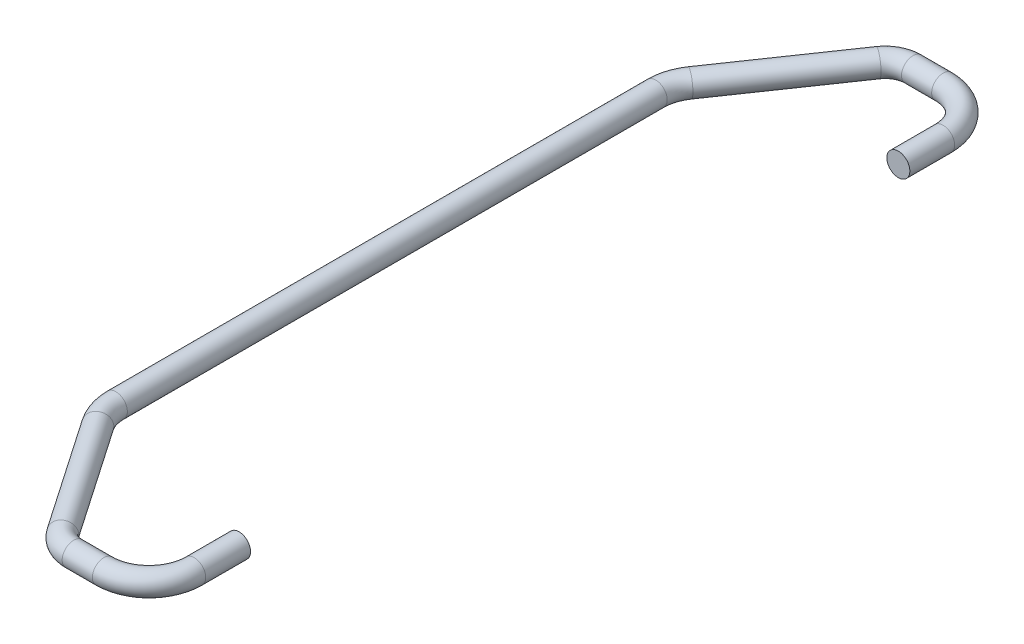
ISO-10303-21;
HEADER;
FILE_DESCRIPTION(('STEP AP214'),'2;1');
FILE_NAME('part.step','',(''),(''),'','','');
FILE_SCHEMA(('AUTOMOTIVE_DESIGN { 1 0 10303 214 1 1 1 1 }'));
ENDSEC;
DATA;
#1=APPLICATION_CONTEXT('core data for automotive mechanical design processes');
#2=APPLICATION_PROTOCOL_DEFINITION('international standard','automotive_design',2000,#1);
#3=PRODUCT_CONTEXT('',#1,'mechanical');
#4=PRODUCT('Part','Part','',(#3));
#5=PRODUCT_RELATED_PRODUCT_CATEGORY('part','',(#4));
#6=PRODUCT_DEFINITION_FORMATION('','',#4);
#7=PRODUCT_DEFINITION_CONTEXT('part definition',#1,'design');
#8=PRODUCT_DEFINITION('design','',#6,#7);
#9=PRODUCT_DEFINITION_SHAPE('','',#8);
#10=(LENGTH_UNIT() NAMED_UNIT(*) SI_UNIT(.MILLI.,.METRE.));
#11=(NAMED_UNIT(*) PLANE_ANGLE_UNIT() SI_UNIT($,.RADIAN.));
#12=(NAMED_UNIT(*) SI_UNIT($,.STERADIAN.) SOLID_ANGLE_UNIT());
#13=UNCERTAINTY_MEASURE_WITH_UNIT(LENGTH_MEASURE(1.E-05),#10,'distance_accuracy_value','');
#14=(GEOMETRIC_REPRESENTATION_CONTEXT(3) GLOBAL_UNCERTAINTY_ASSIGNED_CONTEXT((#13)) GLOBAL_UNIT_ASSIGNED_CONTEXT((#10,
#11,#12)) REPRESENTATION_CONTEXT('',''));
#15=CARTESIAN_POINT('',(0.,0.,0.));
#16=DIRECTION('',(0.,0.,1.));
#17=DIRECTION('',(1.,0.,0.));
#18=AXIS2_PLACEMENT_3D('',#15,#16,#17);
#19=CARTESIAN_POINT('',(8.44658327520551,0.,-103.370487647299));
#20=DIRECTION('',(0.,0.,1.));
#21=DIRECTION('',(1.,0.,0.));
#22=AXIS2_PLACEMENT_3D('',#19,#20,#21);
#23=CYLINDRICAL_SURFACE('',#22,3.175);
#24=CARTESIAN_POINT('',(8.44658327520551,0.,-103.370487647299));
#25=DIRECTION('',(0.,0.,-1.));
#26=DIRECTION('',(-1.,0.,0.));
#27=AXIS2_PLACEMENT_3D('',#24,#25,#26);
#28=CIRCLE('',#27,3.175);
#29=CARTESIAN_POINT('',(11.6215832752055,0.,-103.370487647299));
#30=VERTEX_POINT('',#29);
#31=EDGE_CURVE('E35',#30,#30,#28,.T.);
#32=ORIENTED_EDGE('',*,*,#31,.F.);
#33=EDGE_LOOP('',(#32));
#34=FACE_BOUND('',#33,.T.);
#35=CARTESIAN_POINT('',(8.44658327520551,0.,-90.9984404910032));
#36=DIRECTION('',(0.,0.,-1.));
#37=DIRECTION('',(-1.,0.,0.));
#38=AXIS2_PLACEMENT_3D('',#35,#36,#37);
#39=CIRCLE('',#38,3.175);
#40=CARTESIAN_POINT('',(5.27158327520551,0.,-90.9984404910032));
#41=VERTEX_POINT('',#40);
#42=EDGE_CURVE('E10',#41,#41,#39,.T.);
#43=ORIENTED_EDGE('',*,*,#42,.T.);
#44=EDGE_LOOP('',(#43));
#45=FACE_BOUND('',#44,.T.);
#46=ADVANCED_FACE('F29',(#34,#45),#23,.T.);
#47=CARTESIAN_POINT('',(-4.02716685915848,0.,-103.370487647299));
#48=DIRECTION('',(0.,-1.,0.));
#49=DIRECTION('',(0.,0.,-1.));
#50=AXIS2_PLACEMENT_3D('',#47,#48,#49);
#51=TOROIDAL_SURFACE('',#50,12.473750134364,3.175);
#52=CARTESIAN_POINT('',(-4.02716685915849,0.,-115.844237781663));
#53=DIRECTION('',(-1.,0.,0.));
#54=DIRECTION('',(0.,0.,1.));
#55=AXIS2_PLACEMENT_3D('',#52,#53,#54);
#56=CIRCLE('',#55,3.175);
#57=CARTESIAN_POINT('',(-4.02716685915849,0.,-119.019237781663));
#58=VERTEX_POINT('',#57);
#59=EDGE_CURVE('E39',#58,#58,#56,.T.);
#60=CARTESIAN_POINT('',(-4.02716685915848,0.,-103.370487647299));
#61=DIRECTION('',(0.,-1.,0.));
#62=DIRECTION('',(0.,0.,-1.));
#63=AXIS2_PLACEMENT_3D('',#60,#61,#62);
#64=CIRCLE('',#63,15.648750134364);
#65=EDGE_CURVE('',#58,#30,#64,.T.);
#66=ORIENTED_EDGE('',*,*,#59,.F.);
#67=ORIENTED_EDGE('',*,*,#31,.T.);
#68=ORIENTED_EDGE('',*,*,#65,.T.);
#69=ORIENTED_EDGE('',*,*,#65,.F.);
#70=EDGE_LOOP('',(#66,#68,#67,#69));
#71=FACE_BOUND('',#70,.T.);
#72=ADVANCED_FACE('F99',(#71),#51,.T.);
#73=CARTESIAN_POINT('',(-12.3617825408593,0.,-115.844237781663));
#74=DIRECTION('',(1.,0.,0.));
#75=DIRECTION('',(0.,0.,-1.));
#76=AXIS2_PLACEMENT_3D('',#73,#74,#75);
#77=CYLINDRICAL_SURFACE('',#76,3.175);
#78=CARTESIAN_POINT('',(-12.3617825408593,0.,-115.844237781663));
#79=DIRECTION('',(-1.,0.,0.));
#80=DIRECTION('',(0.,0.,1.));
#81=AXIS2_PLACEMENT_3D('',#78,#79,#80);
#82=CIRCLE('',#81,3.175);
#83=CARTESIAN_POINT('',(-12.3617825408593,0.,-119.019237781663));
#84=VERTEX_POINT('',#83);
#85=EDGE_CURVE('E43',#84,#84,#82,.T.);
#86=ORIENTED_EDGE('',*,*,#85,.F.);
#87=EDGE_LOOP('',(#86));
#88=FACE_BOUND('',#87,.T.);
#89=ORIENTED_EDGE('',*,*,#59,.T.);
#90=EDGE_LOOP('',(#89));
#91=FACE_BOUND('',#90,.T.);
#92=ADVANCED_FACE('F104',(#88,#91),#77,.T.);
#93=CARTESIAN_POINT('',(-12.3617825408593,0.,-108.18590396773));
#94=DIRECTION('',(0.,-1.,0.));
#95=DIRECTION('',(0.,0.,-1.));
#96=AXIS2_PLACEMENT_3D('',#93,#94,#95);
#97=TOROIDAL_SURFACE('',#96,7.65833381393313,3.175);
#98=CARTESIAN_POINT('',(-18.6767273548357,0.,-112.518518513482));
#99=DIRECTION('',(-0.565738534127344,0.,0.824584690012763));
#100=DIRECTION('',(0.824584690012763,0.,0.565738534127344));
#101=AXIS2_PLACEMENT_3D('',#98,#99,#100);
#102=CIRCLE('',#101,3.175);
#103=CARTESIAN_POINT('',(-21.2947837456262,0.,-114.314738359336));
#104=VERTEX_POINT('',#103);
#105=EDGE_CURVE('E48',#104,#104,#102,.T.);
#106=CARTESIAN_POINT('',(-12.3617825408593,0.,-108.18590396773));
#107=DIRECTION('',(0.,-1.,0.));
#108=DIRECTION('',(0.,0.,-1.));
#109=AXIS2_PLACEMENT_3D('',#106,#107,#108);
#110=CIRCLE('',#109,10.8333338139331);
#111=EDGE_CURVE('',#104,#84,#110,.T.);
#112=ORIENTED_EDGE('',*,*,#105,.F.);
#113=ORIENTED_EDGE('',*,*,#85,.T.);
#114=ORIENTED_EDGE('',*,*,#111,.T.);
#115=ORIENTED_EDGE('',*,*,#111,.F.);
#116=EDGE_LOOP('',(#112,#114,#113,#115));
#117=FACE_BOUND('',#116,.T.);
#118=ADVANCED_FACE('F109',(#117),#97,.T.);
#119=CARTESIAN_POINT('',(-39.8093557454584,0.,-81.716936546795));
#120=DIRECTION('',(0.565738534127338,0.,-0.824584690012767));
#121=DIRECTION('',(-0.824584690012767,0.,-0.565738534127338));
#122=AXIS2_PLACEMENT_3D('',#119,#120,#121);
#123=CYLINDRICAL_SURFACE('',#122,3.175);
#124=CARTESIAN_POINT('',(-39.8093557454584,0.,-81.716936546795));
#125=DIRECTION('',(-0.565738534127344,0.,0.824584690012763));
#126=DIRECTION('',(0.824584690012763,0.,0.565738534127344));
#127=AXIS2_PLACEMENT_3D('',#124,#125,#126);
#128=CIRCLE('',#127,3.175);
#129=CARTESIAN_POINT('',(-42.4274121362489,0.,-83.5131563926493));
#130=VERTEX_POINT('',#129);
#131=EDGE_CURVE('E51',#130,#130,#128,.T.);
#132=ORIENTED_EDGE('',*,*,#131,.F.);
#133=EDGE_LOOP('',(#132));
#134=FACE_BOUND('',#133,.T.);
#135=ORIENTED_EDGE('',*,*,#105,.T.);
#136=EDGE_LOOP('',(#135));
#137=FACE_BOUND('',#136,.T.);
#138=ADVANCED_FACE('F95',(#134,#137),#123,.T.);
#139=CARTESIAN_POINT('',(-29.3055207062172,0.,-74.5103702476757));
#140=DIRECTION('',(0.,-1.,0.));
#141=DIRECTION('',(0.,0.,-1.));
#142=AXIS2_PLACEMENT_3D('',#139,#140,#141);
#143=TOROIDAL_SURFACE('',#142,12.7383338139331,3.175);
#144=CARTESIAN_POINT('',(-42.0438545201503,0.,-74.5103702476757));
#145=DIRECTION('',(0.,0.,1.));
#146=DIRECTION('',(1.,0.,0.));
#147=AXIS2_PLACEMENT_3D('',#144,#145,#146);
#148=CIRCLE('',#147,3.175);
#149=CARTESIAN_POINT('',(-45.2188545201503,0.,-74.5103702476756));
#150=VERTEX_POINT('',#149);
#151=EDGE_CURVE('E54',#150,#150,#148,.T.);
#152=CARTESIAN_POINT('',(-29.3055207062172,0.,-74.5103702476757));
#153=DIRECTION('',(0.,-1.,0.));
#154=DIRECTION('',(0.,0.,-1.));
#155=AXIS2_PLACEMENT_3D('',#152,#153,#154);
#156=CIRCLE('',#155,15.9133338139331);
#157=EDGE_CURVE('',#150,#130,#156,.T.);
#158=ORIENTED_EDGE('',*,*,#151,.F.);
#159=ORIENTED_EDGE('',*,*,#131,.T.);
#160=ORIENTED_EDGE('',*,*,#157,.T.);
#161=ORIENTED_EDGE('',*,*,#157,.F.);
#162=EDGE_LOOP('',(#158,#160,#159,#161));
#163=FACE_BOUND('',#162,.T.);
#164=ADVANCED_FACE('F85',(#163),#143,.T.);
#165=CARTESIAN_POINT('',(-42.0438545201503,0.,-74.5103702476757));
#166=DIRECTION('',(0.,0.,1.));
#167=DIRECTION('',(1.,0.,0.));
#168=AXIS2_PLACEMENT_3D('',#165,#166,#167);
#169=CYLINDRICAL_SURFACE('',#168,3.175);
#170=ORIENTED_EDGE('',*,*,#151,.T.);
#171=EDGE_LOOP('',(#170));
#172=FACE_BOUND('',#171,.T.);
#173=CARTESIAN_POINT('',(-42.0438545201503,0.,74.5103702476757));
#174=DIRECTION('',(0.,0.,1.));
#175=DIRECTION('',(1.,0.,0.));
#176=AXIS2_PLACEMENT_3D('',#173,#174,#175);
#177=CIRCLE('',#176,3.175);
#178=CARTESIAN_POINT('',(-45.2188545201503,0.,74.5103702476756));
#179=VERTEX_POINT('',#178);
#180=EDGE_CURVE('E75',#179,#179,#177,.T.);
#181=ORIENTED_EDGE('',*,*,#180,.F.);
#182=EDGE_LOOP('',(#181));
#183=FACE_BOUND('',#182,.T.);
#184=ADVANCED_FACE('F82',(#172,#183),#169,.T.);
#185=CARTESIAN_POINT('',(8.44658327520551,0.,-90.9984404910032));
#186=DIRECTION('',(0.,0.,-1.));
#187=DIRECTION('',(-1.,0.,0.));
#188=AXIS2_PLACEMENT_3D('',#185,#186,#187);
#189=PLANE('',#188);
#190=ORIENTED_EDGE('',*,*,#42,.F.);
#191=EDGE_LOOP('',(#190));
#192=FACE_BOUND('',#191,.T.);
#193=ADVANCED_FACE('F84',(#192),#189,.F.);
#194=CARTESIAN_POINT('',(8.44658327520551,0.,103.370487647299));
#195=DIRECTION('',(0.,0.,-1.));
#196=DIRECTION('',(-1.,0.,0.));
#197=AXIS2_PLACEMENT_3D('',#194,#195,#196);
#198=CYLINDRICAL_SURFACE('',#197,3.175);
#199=CARTESIAN_POINT('',(8.44658327520551,0.,103.370487647299));
#200=DIRECTION('',(0.,0.,-1.));
#201=DIRECTION('',(-1.,0.,0.));
#202=AXIS2_PLACEMENT_3D('',#199,#200,#201);
#203=CIRCLE('',#202,3.175);
#204=CARTESIAN_POINT('',(11.6215832752055,0.,103.370487647299));
#205=VERTEX_POINT('',#204);
#206=EDGE_CURVE('E60',#205,#205,#203,.T.);
#207=ORIENTED_EDGE('',*,*,#206,.T.);
#208=EDGE_LOOP('',(#207));
#209=FACE_BOUND('',#208,.T.);
#210=CARTESIAN_POINT('',(8.44658327520551,0.,90.9984404910032));
#211=DIRECTION('',(0.,0.,-1.));
#212=DIRECTION('',(-1.,0.,0.));
#213=AXIS2_PLACEMENT_3D('',#210,#211,#212);
#214=CIRCLE('',#213,3.175);
#215=CARTESIAN_POINT('',(5.27158327520551,0.,90.9984404910032));
#216=VERTEX_POINT('',#215);
#217=EDGE_CURVE('E57',#216,#216,#214,.T.);
#218=ORIENTED_EDGE('',*,*,#217,.F.);
#219=EDGE_LOOP('',(#218));
#220=FACE_BOUND('',#219,.T.);
#221=ADVANCED_FACE('F92',(#209,#220),#198,.T.);
#222=CARTESIAN_POINT('',(-4.02716685915848,0.,103.370487647299));
#223=DIRECTION('',(0.,1.,0.));
#224=DIRECTION('',(0.,0.,1.));
#225=AXIS2_PLACEMENT_3D('',#222,#223,#224);
#226=TOROIDAL_SURFACE('',#225,12.473750134364,3.175);
#227=CARTESIAN_POINT('',(-4.02716685915849,0.,115.844237781663));
#228=DIRECTION('',(1.,0.,0.));
#229=DIRECTION('',(0.,0.,-1.));
#230=AXIS2_PLACEMENT_3D('',#227,#228,#229);
#231=CIRCLE('',#230,3.175);
#232=CARTESIAN_POINT('',(-4.02716685915849,0.,119.019237781663));
#233=VERTEX_POINT('',#232);
#234=EDGE_CURVE('E63',#233,#233,#231,.T.);
#235=CARTESIAN_POINT('',(-4.02716685915848,0.,103.370487647299));
#236=DIRECTION('',(0.,1.,0.));
#237=DIRECTION('',(0.,0.,1.));
#238=AXIS2_PLACEMENT_3D('',#235,#236,#237);
#239=CIRCLE('',#238,15.648750134364);
#240=EDGE_CURVE('',#233,#205,#239,.T.);
#241=ORIENTED_EDGE('',*,*,#234,.T.);
#242=ORIENTED_EDGE('',*,*,#206,.F.);
#243=ORIENTED_EDGE('',*,*,#240,.T.);
#244=ORIENTED_EDGE('',*,*,#240,.F.);
#245=EDGE_LOOP('',(#241,#243,#242,#244));
#246=FACE_BOUND('',#245,.T.);
#247=ADVANCED_FACE('F154',(#246),#226,.T.);
#248=CARTESIAN_POINT('',(-12.3617825408593,0.,115.844237781663));
#249=DIRECTION('',(1.,0.,0.));
#250=DIRECTION('',(0.,0.,-1.));
#251=AXIS2_PLACEMENT_3D('',#248,#249,#250);
#252=CYLINDRICAL_SURFACE('',#251,3.175);
#253=CARTESIAN_POINT('',(-12.3617825408593,0.,115.844237781663));
#254=DIRECTION('',(1.,0.,0.));
#255=DIRECTION('',(0.,0.,-1.));
#256=AXIS2_PLACEMENT_3D('',#253,#254,#255);
#257=CIRCLE('',#256,3.175);
#258=CARTESIAN_POINT('',(-12.3617825408593,0.,119.019237781663));
#259=VERTEX_POINT('',#258);
#260=EDGE_CURVE('E66',#259,#259,#257,.T.);
#261=ORIENTED_EDGE('',*,*,#260,.T.);
#262=EDGE_LOOP('',(#261));
#263=FACE_BOUND('',#262,.T.);
#264=ORIENTED_EDGE('',*,*,#234,.F.);
#265=EDGE_LOOP('',(#264));
#266=FACE_BOUND('',#265,.T.);
#267=ADVANCED_FACE('F164',(#263,#266),#252,.T.);
#268=CARTESIAN_POINT('',(-12.3617825408593,0.,108.18590396773));
#269=DIRECTION('',(0.,1.,0.));
#270=DIRECTION('',(0.,0.,1.));
#271=AXIS2_PLACEMENT_3D('',#268,#269,#270);
#272=TOROIDAL_SURFACE('',#271,7.65833381393313,3.175);
#273=CARTESIAN_POINT('',(-18.6767273548357,0.,112.518518513482));
#274=DIRECTION('',(0.565738534127344,0.,0.824584690012763));
#275=DIRECTION('',(0.824584690012763,0.,-0.565738534127344));
#276=AXIS2_PLACEMENT_3D('',#273,#274,#275);
#277=CIRCLE('',#276,3.175);
#278=CARTESIAN_POINT('',(-21.2947837456262,0.,114.314738359336));
#279=VERTEX_POINT('',#278);
#280=EDGE_CURVE('E69',#279,#279,#277,.T.);
#281=CARTESIAN_POINT('',(-12.3617825408593,0.,108.18590396773));
#282=DIRECTION('',(0.,1.,0.));
#283=DIRECTION('',(0.,0.,1.));
#284=AXIS2_PLACEMENT_3D('',#281,#282,#283);
#285=CIRCLE('',#284,10.8333338139331);
#286=EDGE_CURVE('',#279,#259,#285,.T.);
#287=ORIENTED_EDGE('',*,*,#280,.T.);
#288=ORIENTED_EDGE('',*,*,#260,.F.);
#289=ORIENTED_EDGE('',*,*,#286,.T.);
#290=ORIENTED_EDGE('',*,*,#286,.F.);
#291=EDGE_LOOP('',(#287,#289,#288,#290));
#292=FACE_BOUND('',#291,.T.);
#293=ADVANCED_FACE('F174',(#292),#272,.T.);
#294=CARTESIAN_POINT('',(-39.8093557454584,0.,81.716936546795));
#295=DIRECTION('',(0.565738534127338,0.,0.824584690012767));
#296=DIRECTION('',(0.824584690012767,0.,-0.565738534127338));
#297=AXIS2_PLACEMENT_3D('',#294,#295,#296);
#298=CYLINDRICAL_SURFACE('',#297,3.175);
#299=CARTESIAN_POINT('',(-39.8093557454584,0.,81.716936546795));
#300=DIRECTION('',(0.565738534127344,0.,0.824584690012763));
#301=DIRECTION('',(0.824584690012763,0.,-0.565738534127344));
#302=AXIS2_PLACEMENT_3D('',#299,#300,#301);
#303=CIRCLE('',#302,3.175);
#304=CARTESIAN_POINT('',(-42.4274121362489,0.,83.5131563926493));
#305=VERTEX_POINT('',#304);
#306=EDGE_CURVE('E72',#305,#305,#303,.T.);
#307=ORIENTED_EDGE('',*,*,#306,.T.);
#308=EDGE_LOOP('',(#307));
#309=FACE_BOUND('',#308,.T.);
#310=ORIENTED_EDGE('',*,*,#280,.F.);
#311=EDGE_LOOP('',(#310));
#312=FACE_BOUND('',#311,.T.);
#313=ADVANCED_FACE('F184',(#309,#312),#298,.T.);
#314=CARTESIAN_POINT('',(-29.3055207062172,0.,74.5103702476757));
#315=DIRECTION('',(0.,1.,0.));
#316=DIRECTION('',(0.,0.,1.));
#317=AXIS2_PLACEMENT_3D('',#314,#315,#316);
#318=TOROIDAL_SURFACE('',#317,12.7383338139331,3.175);
#319=CARTESIAN_POINT('',(-29.3055207062172,0.,74.5103702476757));
#320=DIRECTION('',(0.,1.,0.));
#321=DIRECTION('',(0.,0.,1.));
#322=AXIS2_PLACEMENT_3D('',#319,#320,#321);
#323=CIRCLE('',#322,15.9133338139331);
#324=EDGE_CURVE('',#179,#305,#323,.T.);
#325=ORIENTED_EDGE('',*,*,#180,.T.);
#326=ORIENTED_EDGE('',*,*,#306,.F.);
#327=ORIENTED_EDGE('',*,*,#324,.T.);
#328=ORIENTED_EDGE('',*,*,#324,.F.);
#329=EDGE_LOOP('',(#325,#327,#326,#328));
#330=FACE_BOUND('',#329,.T.);
#331=ADVANCED_FACE('F79',(#330),#318,.T.);
#332=CARTESIAN_POINT('',(8.44658327520551,0.,90.9984404910032));
#333=DIRECTION('',(0.,0.,1.));
#334=DIRECTION('',(-1.,0.,0.));
#335=AXIS2_PLACEMENT_3D('',#332,#333,#334);
#336=PLANE('',#335);
#337=ORIENTED_EDGE('',*,*,#217,.T.);
#338=EDGE_LOOP('',(#337));
#339=FACE_BOUND('',#338,.T.);
#340=ADVANCED_FACE('F203',(#339),#336,.F.);
#341=CLOSED_SHELL('',(#46,#72,#92,#118,#138,#164,#184,#193,#221,#247,#267,#293,#313,#331,#340));
#342=MANIFOLD_SOLID_BREP('B2',#341);
#343=ADVANCED_BREP_SHAPE_REPRESENTATION('',(#18,#342),#14);
#344=SHAPE_DEFINITION_REPRESENTATION(#9,#343);
ENDSEC;
END-ISO-10303-21;
